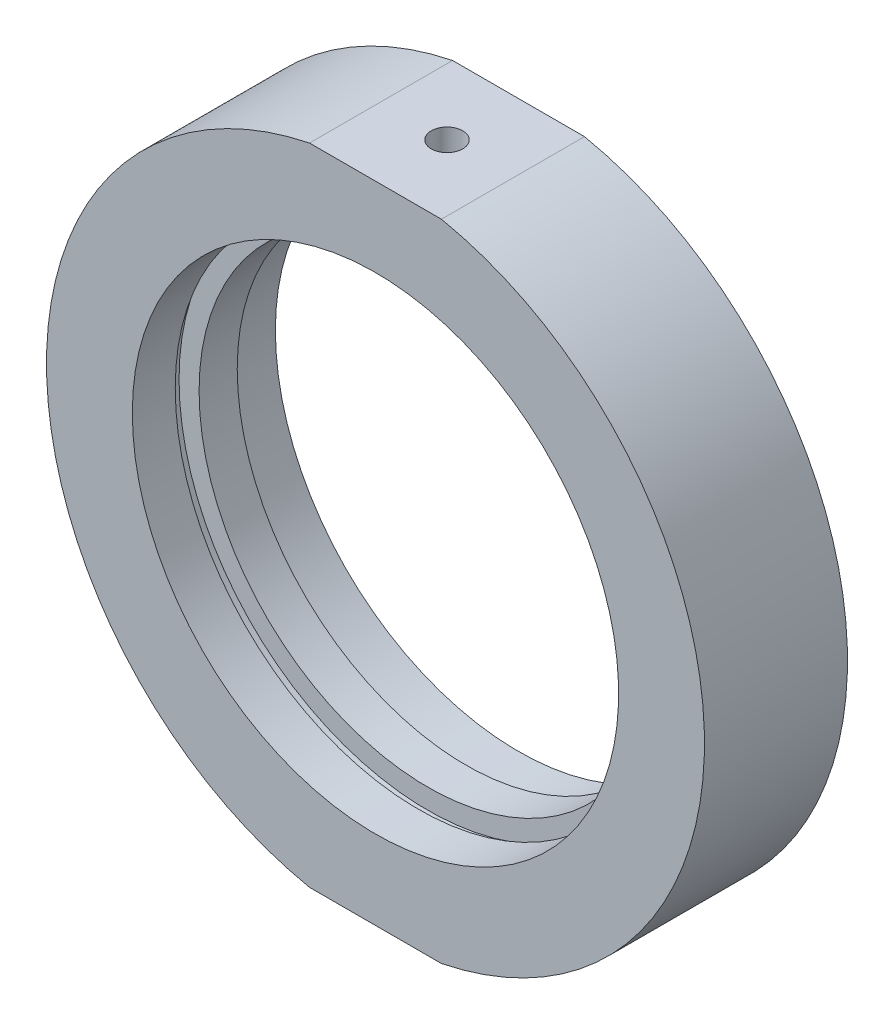
ISO-10303-21;
HEADER;
FILE_DESCRIPTION(('STEP AP214'),'2;1');
FILE_NAME('part.step','',(''),(''),'','','');
FILE_SCHEMA(('AUTOMOTIVE_DESIGN { 1 0 10303 214 1 1 1 1 }'));
ENDSEC;
DATA;
#1=APPLICATION_CONTEXT('core data for automotive mechanical design processes');
#2=APPLICATION_PROTOCOL_DEFINITION('international standard','automotive_design',2000,#1);
#3=PRODUCT_CONTEXT('',#1,'mechanical');
#4=PRODUCT('Part','Part','',(#3));
#5=PRODUCT_RELATED_PRODUCT_CATEGORY('part','',(#4));
#6=PRODUCT_DEFINITION_FORMATION('','',#4);
#7=PRODUCT_DEFINITION_CONTEXT('part definition',#1,'design');
#8=PRODUCT_DEFINITION('design','',#6,#7);
#9=PRODUCT_DEFINITION_SHAPE('','',#8);
#10=(LENGTH_UNIT() NAMED_UNIT(*) SI_UNIT(.MILLI.,.METRE.));
#11=(NAMED_UNIT(*) PLANE_ANGLE_UNIT() SI_UNIT($,.RADIAN.));
#12=(NAMED_UNIT(*) SI_UNIT($,.STERADIAN.) SOLID_ANGLE_UNIT());
#13=UNCERTAINTY_MEASURE_WITH_UNIT(LENGTH_MEASURE(1.E-05),#10,'distance_accuracy_value','');
#14=(GEOMETRIC_REPRESENTATION_CONTEXT(3) GLOBAL_UNCERTAINTY_ASSIGNED_CONTEXT((#13)) GLOBAL_UNIT_ASSIGNED_CONTEXT((#10,
#11,#12)) REPRESENTATION_CONTEXT('',''));
#15=CARTESIAN_POINT('',(0.,0.,0.));
#16=DIRECTION('',(0.,0.,1.));
#17=DIRECTION('',(1.,0.,0.));
#18=AXIS2_PLACEMENT_3D('',#15,#16,#17);
#19=CARTESIAN_POINT('',(-33.1519726534682,33.8,-41.5));
#20=DIRECTION('',(0.,-1.,0.));
#21=DIRECTION('',(0.,0.,-1.));
#22=AXIS2_PLACEMENT_3D('',#19,#20,#21);
#23=PLANE('',#22);
#24=DIRECTION('',(1.,0.,0.));
#25=VECTOR('',#24,1.);
#26=CARTESIAN_POINT('',(-33.1519726534682,33.8,7.5));
#27=LINE('',#26,#25);
#28=CARTESIAN_POINT('',(-6.914477565225,33.8,7.5));
#29=VERTEX_POINT('',#28);
#30=CARTESIAN_POINT('',(6.91447756522501,33.8,7.5));
#31=VERTEX_POINT('',#30);
#32=EDGE_CURVE('E122',#29,#31,#27,.T.);
#33=ORIENTED_EDGE('',*,*,#32,.T.);
#34=DIRECTION('',(0.,0.,-1.));
#35=VECTOR('',#34,1.);
#36=CARTESIAN_POINT('',(6.91447756522507,33.8,-31.9390681003584));
#37=LINE('',#36,#35);
#38=CARTESIAN_POINT('',(6.91447756522504,33.8,-7.5));
#39=VERTEX_POINT('',#38);
#40=EDGE_CURVE('E63',#39,#31,#37,.F.);
#41=ORIENTED_EDGE('',*,*,#40,.F.);
#42=DIRECTION('',(1.,0.,0.));
#43=VECTOR('',#42,1.);
#44=CARTESIAN_POINT('',(25.5,33.8,-7.5));
#45=LINE('',#44,#43);
#46=CARTESIAN_POINT('',(-6.91447756522503,33.8,-7.5));
#47=VERTEX_POINT('',#46);
#48=EDGE_CURVE('E49',#47,#39,#45,.T.);
#49=ORIENTED_EDGE('',*,*,#48,.F.);
#50=DIRECTION('',(0.,0.,-1.));
#51=VECTOR('',#50,1.);
#52=CARTESIAN_POINT('',(-6.91447756522507,33.8,-31.9390681003584));
#53=LINE('',#52,#51);
#54=EDGE_CURVE('E127',#29,#47,#53,.T.);
#55=ORIENTED_EDGE('',*,*,#54,.F.);
#56=EDGE_LOOP('',(#33,#41,#49,#55));
#57=FACE_BOUND('',#56,.T.);
#58=CARTESIAN_POINT('',(0.,33.8,0.));
#59=DIRECTION('',(0.,1.,0.));
#60=DIRECTION('',(0.,0.,1.));
#61=AXIS2_PLACEMENT_3D('',#58,#59,#60);
#62=CIRCLE('',#61,1.64999999999999);
#63=CARTESIAN_POINT('',(0.,33.8,1.64999999999999));
#64=VERTEX_POINT('',#63);
#65=EDGE_CURVE('E97',#64,#64,#62,.T.);
#66=ORIENTED_EDGE('',*,*,#65,.F.);
#67=EDGE_LOOP('',(#66));
#68=FACE_BOUND('',#67,.T.);
#69=ADVANCED_FACE('F40',(#57,#68),#23,.F.);
#70=CARTESIAN_POINT('',(0.,0.,-31.9390681003584));
#71=DIRECTION('',(0.,0.,-1.));
#72=DIRECTION('',(-1.,0.,0.));
#73=AXIS2_PLACEMENT_3D('',#70,#71,#72);
#74=CYLINDRICAL_SURFACE('',#73,34.5);
#75=CARTESIAN_POINT('',(0.,0.,7.50000000000001));
#76=DIRECTION('',(0.,0.,-1.));
#77=DIRECTION('',(-1.,0.,0.));
#78=AXIS2_PLACEMENT_3D('',#75,#76,#77);
#79=CIRCLE('',#78,34.5);
#80=CARTESIAN_POINT('',(6.91447756522501,-33.8,7.5));
#81=VERTEX_POINT('',#80);
#82=EDGE_CURVE('E149',#31,#81,#79,.T.);
#83=ORIENTED_EDGE('',*,*,#82,.T.);
#84=DIRECTION('',(0.,0.,-1.));
#85=VECTOR('',#84,1.);
#86=CARTESIAN_POINT('',(6.91447756522507,-33.8,-31.9390681003584));
#87=LINE('',#86,#85);
#88=CARTESIAN_POINT('',(6.91447756522504,-33.8,-7.5));
#89=VERTEX_POINT('',#88);
#90=EDGE_CURVE('E118',#81,#89,#87,.T.);
#91=ORIENTED_EDGE('',*,*,#90,.T.);
#92=CARTESIAN_POINT('',(0.,0.,-7.5));
#93=DIRECTION('',(0.,0.,-1.));
#94=DIRECTION('',(-1.,0.,0.));
#95=AXIS2_PLACEMENT_3D('',#92,#93,#94);
#96=CIRCLE('',#95,34.5);
#97=EDGE_CURVE('E144',#39,#89,#96,.T.);
#98=ORIENTED_EDGE('',*,*,#97,.F.);
#99=ORIENTED_EDGE('',*,*,#40,.T.);
#100=EDGE_LOOP('',(#83,#91,#98,#99));
#101=FACE_BOUND('',#100,.T.);
#102=ADVANCED_FACE('F185',(#101),#74,.T.);
#103=CARTESIAN_POINT('',(0.,0.,-31.9390681003584));
#104=DIRECTION('',(0.,0.,-1.));
#105=DIRECTION('',(-1.,0.,0.));
#106=AXIS2_PLACEMENT_3D('',#103,#104,#105);
#107=CYLINDRICAL_SURFACE('',#106,26.1);
#108=CARTESIAN_POINT('',(0.,0.,-2.));
#109=DIRECTION('',(0.,0.,-1.));
#110=DIRECTION('',(-1.,0.,0.));
#111=AXIS2_PLACEMENT_3D('',#108,#109,#110);
#112=CIRCLE('',#111,26.1);
#113=CARTESIAN_POINT('',(-26.1,0.,-2.));
#114=VERTEX_POINT('',#113);
#115=EDGE_CURVE('E176',#114,#114,#112,.T.);
#116=ORIENTED_EDGE('',*,*,#115,.F.);
#117=EDGE_LOOP('',(#116));
#118=FACE_BOUND('',#117,.T.);
#119=CARTESIAN_POINT('',(0.,0.,-3.));
#120=DIRECTION('',(0.,0.,-1.));
#121=DIRECTION('',(-1.,0.,0.));
#122=AXIS2_PLACEMENT_3D('',#119,#120,#121);
#123=CIRCLE('',#122,26.1);
#124=CARTESIAN_POINT('',(-26.1,0.,-3.));
#125=VERTEX_POINT('',#124);
#126=EDGE_CURVE('E131',#125,#125,#123,.T.);
#127=ORIENTED_EDGE('',*,*,#126,.T.);
#128=EDGE_LOOP('',(#127));
#129=FACE_BOUND('',#128,.T.);
#130=ADVANCED_FACE('F42',(#118,#129),#107,.F.);
#131=CARTESIAN_POINT('',(24.,0.,-2.));
#132=DIRECTION('',(0.,0.,1.));
#133=DIRECTION('',(1.,0.,0.));
#134=AXIS2_PLACEMENT_3D('',#131,#132,#133);
#135=PLANE('',#134);
#136=CARTESIAN_POINT('',(0.,0.,-2.));
#137=DIRECTION('',(0.,0.,-1.));
#138=DIRECTION('',(-1.,0.,0.));
#139=AXIS2_PLACEMENT_3D('',#136,#137,#138);
#140=CIRCLE('',#139,24.);
#141=CARTESIAN_POINT('',(-24.,0.,-2.));
#142=VERTEX_POINT('',#141);
#143=EDGE_CURVE('E172',#142,#142,#140,.T.);
#144=ORIENTED_EDGE('',*,*,#143,.F.);
#145=EDGE_LOOP('',(#144));
#146=FACE_BOUND('',#145,.T.);
#147=ORIENTED_EDGE('',*,*,#115,.T.);
#148=EDGE_LOOP('',(#147));
#149=FACE_BOUND('',#148,.T.);
#150=ADVANCED_FACE('F250',(#146,#149),#135,.F.);
#151=CARTESIAN_POINT('',(0.,0.,-31.9390681003584));
#152=DIRECTION('',(0.,0.,-1.));
#153=DIRECTION('',(-1.,0.,0.));
#154=AXIS2_PLACEMENT_3D('',#151,#152,#153);
#155=CYLINDRICAL_SURFACE('',#154,24.);
#156=CARTESIAN_POINT('',(0.,0.,2.));
#157=DIRECTION('',(0.,0.,-1.));
#158=DIRECTION('',(-1.,0.,0.));
#159=AXIS2_PLACEMENT_3D('',#156,#157,#158);
#160=CIRCLE('',#159,24.);
#161=CARTESIAN_POINT('',(-24.,0.,2.));
#162=VERTEX_POINT('',#161);
#163=EDGE_CURVE('E168',#162,#162,#160,.T.);
#164=ORIENTED_EDGE('',*,*,#163,.F.);
#165=EDGE_LOOP('',(#164));
#166=FACE_BOUND('',#165,.T.);
#167=ORIENTED_EDGE('',*,*,#143,.T.);
#168=EDGE_LOOP('',(#167));
#169=FACE_BOUND('',#168,.T.);
#170=ADVANCED_FACE('F247',(#166,#169),#155,.F.);
#171=CARTESIAN_POINT('',(25.5,0.,2.));
#172=DIRECTION('',(0.,0.,-1.));
#173=DIRECTION('',(-1.,0.,0.));
#174=AXIS2_PLACEMENT_3D('',#171,#172,#173);
#175=PLANE('',#174);
#176=CARTESIAN_POINT('',(0.,0.,2.));
#177=DIRECTION('',(0.,0.,-1.));
#178=DIRECTION('',(-1.,0.,0.));
#179=AXIS2_PLACEMENT_3D('',#176,#177,#178);
#180=CIRCLE('',#179,26.1);
#181=CARTESIAN_POINT('',(-26.1,0.,2.));
#182=VERTEX_POINT('',#181);
#183=EDGE_CURVE('E164',#182,#182,#180,.T.);
#184=ORIENTED_EDGE('',*,*,#183,.F.);
#185=EDGE_LOOP('',(#184));
#186=FACE_BOUND('',#185,.T.);
#187=ORIENTED_EDGE('',*,*,#163,.T.);
#188=EDGE_LOOP('',(#187));
#189=FACE_BOUND('',#188,.T.);
#190=ADVANCED_FACE('F243',(#186,#189),#175,.F.);
#191=CARTESIAN_POINT('',(0.,0.,-31.9390681003584));
#192=DIRECTION('',(0.,0.,-1.));
#193=DIRECTION('',(-1.,0.,0.));
#194=AXIS2_PLACEMENT_3D('',#191,#192,#193);
#195=CYLINDRICAL_SURFACE('',#194,26.1);
#196=CARTESIAN_POINT('',(0.,0.,3.));
#197=DIRECTION('',(0.,0.,-1.));
#198=DIRECTION('',(-1.,0.,0.));
#199=AXIS2_PLACEMENT_3D('',#196,#197,#198);
#200=CIRCLE('',#199,26.1);
#201=CARTESIAN_POINT('',(-26.1,0.,3.00000000000001));
#202=VERTEX_POINT('',#201);
#203=EDGE_CURVE('E161',#202,#202,#200,.T.);
#204=ORIENTED_EDGE('',*,*,#203,.F.);
#205=EDGE_LOOP('',(#204));
#206=FACE_BOUND('',#205,.T.);
#207=ORIENTED_EDGE('',*,*,#183,.T.);
#208=EDGE_LOOP('',(#207));
#209=FACE_BOUND('',#208,.T.);
#210=ADVANCED_FACE('F239',(#206,#209),#195,.F.);
#211=CARTESIAN_POINT('',(26.1,0.,3.));
#212=DIRECTION('',(0.,0.,1.));
#213=DIRECTION('',(1.,0.,0.));
#214=AXIS2_PLACEMENT_3D('',#211,#212,#213);
#215=PLANE('',#214);
#216=CARTESIAN_POINT('',(0.,0.,3.));
#217=DIRECTION('',(0.,0.,-1.));
#218=DIRECTION('',(-1.,0.,0.));
#219=AXIS2_PLACEMENT_3D('',#216,#217,#218);
#220=CIRCLE('',#219,25.5);
#221=CARTESIAN_POINT('',(-25.5,0.,3.00000000000001));
#222=VERTEX_POINT('',#221);
#223=EDGE_CURVE('E157',#222,#222,#220,.T.);
#224=ORIENTED_EDGE('',*,*,#223,.F.);
#225=EDGE_LOOP('',(#224));
#226=FACE_BOUND('',#225,.T.);
#227=ORIENTED_EDGE('',*,*,#203,.T.);
#228=EDGE_LOOP('',(#227));
#229=FACE_BOUND('',#228,.T.);
#230=ADVANCED_FACE('F235',(#226,#229),#215,.F.);
#231=CARTESIAN_POINT('',(0.,0.,-31.9390681003584));
#232=DIRECTION('',(0.,0.,-1.));
#233=DIRECTION('',(-1.,0.,0.));
#234=AXIS2_PLACEMENT_3D('',#231,#232,#233);
#235=CYLINDRICAL_SURFACE('',#234,25.5);
#236=CARTESIAN_POINT('',(0.,0.,7.5));
#237=DIRECTION('',(0.,0.,-1.));
#238=DIRECTION('',(-1.,0.,0.));
#239=AXIS2_PLACEMENT_3D('',#236,#237,#238);
#240=CIRCLE('',#239,25.5);
#241=CARTESIAN_POINT('',(-25.5,0.,7.5));
#242=VERTEX_POINT('',#241);
#243=EDGE_CURVE('E153',#242,#242,#240,.T.);
#244=ORIENTED_EDGE('',*,*,#243,.F.);
#245=EDGE_LOOP('',(#244));
#246=FACE_BOUND('',#245,.T.);
#247=ORIENTED_EDGE('',*,*,#223,.T.);
#248=EDGE_LOOP('',(#247));
#249=FACE_BOUND('',#248,.T.);
#250=ADVANCED_FACE('F232',(#246,#249),#235,.F.);
#251=CARTESIAN_POINT('',(34.5,0.,7.5));
#252=DIRECTION('',(0.,0.,-1.));
#253=DIRECTION('',(-1.,0.,0.));
#254=AXIS2_PLACEMENT_3D('',#251,#252,#253);
#255=PLANE('',#254);
#256=CARTESIAN_POINT('',(-6.914477565225,-33.8,7.5));
#257=VERTEX_POINT('',#256);
#258=EDGE_CURVE('E148',#257,#29,#79,.T.);
#259=ORIENTED_EDGE('',*,*,#258,.F.);
#260=DIRECTION('',(-1.,0.,0.));
#261=VECTOR('',#260,1.);
#262=CARTESIAN_POINT('',(-33.1519726534682,-33.8,7.5));
#263=LINE('',#262,#261);
#264=EDGE_CURVE('E113',#81,#257,#263,.T.);
#265=ORIENTED_EDGE('',*,*,#264,.F.);
#266=ORIENTED_EDGE('',*,*,#82,.F.);
#267=ORIENTED_EDGE('',*,*,#32,.F.);
#268=EDGE_LOOP('',(#259,#265,#266,#267));
#269=FACE_BOUND('',#268,.T.);
#270=ORIENTED_EDGE('',*,*,#243,.T.);
#271=EDGE_LOOP('',(#270));
#272=FACE_BOUND('',#271,.T.);
#273=ADVANCED_FACE('F191',(#269,#272),#255,.F.);
#274=CARTESIAN_POINT('',(-6.91447756522503,-33.8,-7.5));
#275=VERTEX_POINT('',#274);
#276=EDGE_CURVE('E143',#275,#47,#96,.T.);
#277=ORIENTED_EDGE('',*,*,#276,.F.);
#278=DIRECTION('',(0.,0.,-1.));
#279=VECTOR('',#278,1.);
#280=CARTESIAN_POINT('',(-6.91447756522507,-33.8,-31.9390681003584));
#281=LINE('',#280,#279);
#282=EDGE_CURVE('E56',#275,#257,#281,.F.);
#283=ORIENTED_EDGE('',*,*,#282,.T.);
#284=ORIENTED_EDGE('',*,*,#258,.T.);
#285=ORIENTED_EDGE('',*,*,#54,.T.);
#286=EDGE_LOOP('',(#277,#283,#284,#285));
#287=FACE_BOUND('',#286,.T.);
#288=ADVANCED_FACE('F196',(#287),#74,.T.);
#289=CARTESIAN_POINT('',(25.5,0.,-7.5));
#290=DIRECTION('',(0.,0.,1.));
#291=DIRECTION('',(1.,0.,0.));
#292=AXIS2_PLACEMENT_3D('',#289,#290,#291);
#293=PLANE('',#292);
#294=CARTESIAN_POINT('',(0.,0.,-7.5));
#295=DIRECTION('',(0.,0.,-1.));
#296=DIRECTION('',(-1.,0.,0.));
#297=AXIS2_PLACEMENT_3D('',#294,#295,#296);
#298=CIRCLE('',#297,25.5);
#299=CARTESIAN_POINT('',(-25.5,0.,-7.49999999999999));
#300=VERTEX_POINT('',#299);
#301=EDGE_CURVE('E139',#300,#300,#298,.T.);
#302=ORIENTED_EDGE('',*,*,#301,.F.);
#303=EDGE_LOOP('',(#302));
#304=FACE_BOUND('',#303,.T.);
#305=ORIENTED_EDGE('',*,*,#97,.T.);
#306=DIRECTION('',(-1.,0.,0.));
#307=VECTOR('',#306,1.);
#308=CARTESIAN_POINT('',(25.5,-33.8,-7.5));
#309=LINE('',#308,#307);
#310=EDGE_CURVE('E11',#89,#275,#309,.T.);
#311=ORIENTED_EDGE('',*,*,#310,.T.);
#312=ORIENTED_EDGE('',*,*,#276,.T.);
#313=ORIENTED_EDGE('',*,*,#48,.T.);
#314=EDGE_LOOP('',(#305,#311,#312,#313));
#315=FACE_BOUND('',#314,.T.);
#316=ADVANCED_FACE('F181',(#304,#315),#293,.F.);
#317=CARTESIAN_POINT('',(0.,0.,-31.9390681003584));
#318=DIRECTION('',(0.,0.,-1.));
#319=DIRECTION('',(-1.,0.,0.));
#320=AXIS2_PLACEMENT_3D('',#317,#318,#319);
#321=CYLINDRICAL_SURFACE('',#320,25.5);
#322=CARTESIAN_POINT('',(0.,0.,-3.));
#323=DIRECTION('',(0.,0.,-1.));
#324=DIRECTION('',(-1.,0.,0.));
#325=AXIS2_PLACEMENT_3D('',#322,#323,#324);
#326=CIRCLE('',#325,25.5);
#327=CARTESIAN_POINT('',(-25.5,0.,-3.));
#328=VERTEX_POINT('',#327);
#329=EDGE_CURVE('E135',#328,#328,#326,.T.);
#330=ORIENTED_EDGE('',*,*,#329,.F.);
#331=EDGE_LOOP('',(#330));
#332=FACE_BOUND('',#331,.T.);
#333=ORIENTED_EDGE('',*,*,#301,.T.);
#334=EDGE_LOOP('',(#333));
#335=FACE_BOUND('',#334,.T.);
#336=ADVANCED_FACE('F220',(#332,#335),#321,.F.);
#337=CARTESIAN_POINT('',(26.1,0.,-3.));
#338=DIRECTION('',(0.,0.,-1.));
#339=DIRECTION('',(-1.,0.,0.));
#340=AXIS2_PLACEMENT_3D('',#337,#338,#339);
#341=PLANE('',#340);
#342=ORIENTED_EDGE('',*,*,#126,.F.);
#343=EDGE_LOOP('',(#342));
#344=FACE_BOUND('',#343,.T.);
#345=ORIENTED_EDGE('',*,*,#329,.T.);
#346=EDGE_LOOP('',(#345));
#347=FACE_BOUND('',#346,.T.);
#348=ADVANCED_FACE('F215',(#344,#347),#341,.F.);
#349=CARTESIAN_POINT('',(-33.1519726534682,-33.8,-41.5));
#350=DIRECTION('',(0.,1.,0.));
#351=DIRECTION('',(0.,0.,1.));
#352=AXIS2_PLACEMENT_3D('',#349,#350,#351);
#353=PLANE('',#352);
#354=CARTESIAN_POINT('',(0.,-33.8,0.));
#355=DIRECTION('',(0.,-1.,0.));
#356=DIRECTION('',(0.,0.,-1.));
#357=AXIS2_PLACEMENT_3D('',#354,#355,#356);
#358=CIRCLE('',#357,2.5);
#359=CARTESIAN_POINT('',(0.,-33.8,-2.5));
#360=VERTEX_POINT('',#359);
#361=EDGE_CURVE('E98',#360,#360,#358,.T.);
#362=ORIENTED_EDGE('',*,*,#361,.F.);
#363=EDGE_LOOP('',(#362));
#364=FACE_BOUND('',#363,.T.);
#365=ORIENTED_EDGE('',*,*,#264,.T.);
#366=ORIENTED_EDGE('',*,*,#282,.F.);
#367=ORIENTED_EDGE('',*,*,#310,.F.);
#368=ORIENTED_EDGE('',*,*,#90,.F.);
#369=EDGE_LOOP('',(#365,#366,#367,#368));
#370=FACE_BOUND('',#369,.T.);
#371=ADVANCED_FACE('F188',(#364,#370),#353,.F.);
#372=CARTESIAN_POINT('',(0.,28.3,0.));
#373=DIRECTION('',(0.,1.,0.));
#374=DIRECTION('',(0.,0.,1.));
#375=AXIS2_PLACEMENT_3D('',#372,#373,#374);
#376=CONICAL_SURFACE('',#375,1.65,1.02974425867665);
#377=CARTESIAN_POINT('',(0.,27.3085799786045,0.));
#378=VERTEX_POINT('',#377);
#379=VERTEX_LOOP('',#378);
#380=FACE_BOUND('',#379,.T.);
#381=CARTESIAN_POINT('',(0.,28.3,0.));
#382=DIRECTION('',(0.,1.,0.));
#383=DIRECTION('',(0.,0.,1.));
#384=AXIS2_PLACEMENT_3D('',#381,#382,#383);
#385=CIRCLE('',#384,1.65);
#386=CARTESIAN_POINT('',(0.,28.3,1.65));
#387=VERTEX_POINT('',#386);
#388=EDGE_CURVE('E104',#387,#387,#385,.T.);
#389=ORIENTED_EDGE('',*,*,#388,.T.);
#390=EDGE_LOOP('',(#389));
#391=FACE_BOUND('',#390,.T.);
#392=ADVANCED_FACE('F203',(#380,#391),#376,.F.);
#393=CARTESIAN_POINT('',(0.,33.8,0.));
#394=DIRECTION('',(0.,1.,0.));
#395=DIRECTION('',(0.,0.,1.));
#396=AXIS2_PLACEMENT_3D('',#393,#394,#395);
#397=CYLINDRICAL_SURFACE('',#396,1.64999999999999);
#398=ORIENTED_EDGE('',*,*,#388,.F.);
#399=EDGE_LOOP('',(#398));
#400=FACE_BOUND('',#399,.T.);
#401=ORIENTED_EDGE('',*,*,#65,.T.);
#402=EDGE_LOOP('',(#401));
#403=FACE_BOUND('',#402,.T.);
#404=ADVANCED_FACE('F90',(#400,#403),#397,.F.);
#405=CARTESIAN_POINT('',(0.,-28.3,0.));
#406=DIRECTION('',(0.,-1.,0.));
#407=DIRECTION('',(0.,0.,-1.));
#408=AXIS2_PLACEMENT_3D('',#405,#406,#407);
#409=CONICAL_SURFACE('',#408,2.5,1.02974425867665);
#410=CARTESIAN_POINT('',(0.,-26.7978484524311,0.));
#411=VERTEX_POINT('',#410);
#412=VERTEX_LOOP('',#411);
#413=FACE_BOUND('',#412,.T.);
#414=CARTESIAN_POINT('',(0.,-28.3,0.));
#415=DIRECTION('',(0.,-1.,0.));
#416=DIRECTION('',(0.,0.,-1.));
#417=AXIS2_PLACEMENT_3D('',#414,#415,#416);
#418=CIRCLE('',#417,2.5);
#419=CARTESIAN_POINT('',(0.,-28.3,-2.5));
#420=VERTEX_POINT('',#419);
#421=EDGE_CURVE('E94',#420,#420,#418,.T.);
#422=ORIENTED_EDGE('',*,*,#421,.T.);
#423=EDGE_LOOP('',(#422));
#424=FACE_BOUND('',#423,.T.);
#425=ADVANCED_FACE('F86',(#413,#424),#409,.F.);
#426=CARTESIAN_POINT('',(0.,-33.8,0.));
#427=DIRECTION('',(0.,-1.,0.));
#428=DIRECTION('',(0.,0.,-1.));
#429=AXIS2_PLACEMENT_3D('',#426,#427,#428);
#430=CYLINDRICAL_SURFACE('',#429,2.5);
#431=ORIENTED_EDGE('',*,*,#421,.F.);
#432=EDGE_LOOP('',(#431));
#433=FACE_BOUND('',#432,.T.);
#434=ORIENTED_EDGE('',*,*,#361,.T.);
#435=EDGE_LOOP('',(#434));
#436=FACE_BOUND('',#435,.T.);
#437=ADVANCED_FACE('F89',(#433,#436),#430,.F.);
#438=CLOSED_SHELL('',(#69,#102,#130,#150,#170,#190,#210,#230,#250,#273,#288,#316,#336,#348,#371,
#392,#404,#425,#437));
#439=MANIFOLD_SOLID_BREP('B2',#438);
#440=ADVANCED_BREP_SHAPE_REPRESENTATION('',(#18,#439),#14);
#441=SHAPE_DEFINITION_REPRESENTATION(#9,#440);
ENDSEC;
END-ISO-10303-21;
